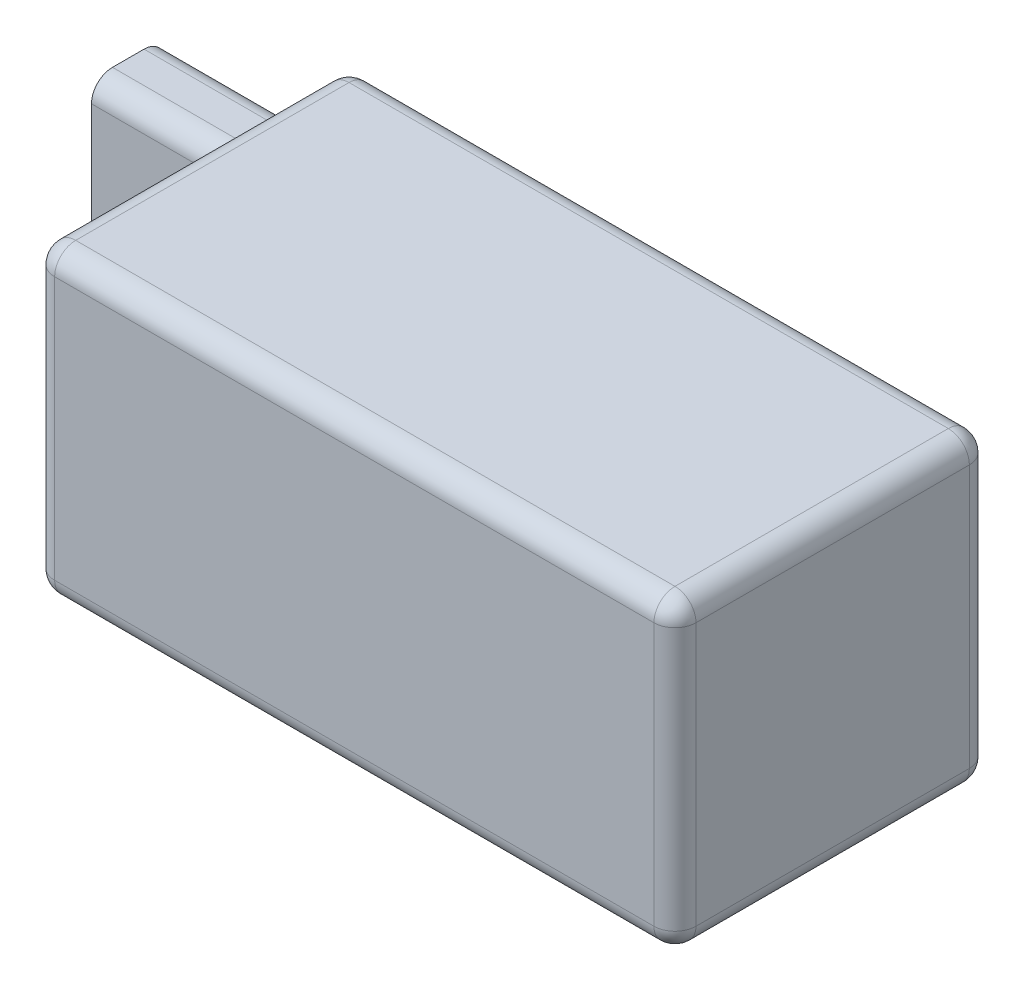
ISO-10303-21;
HEADER;
FILE_DESCRIPTION(('STEP AP214'),'2;1');
FILE_NAME('part.step','',(''),(''),'','','');
FILE_SCHEMA(('AUTOMOTIVE_DESIGN { 1 0 10303 214 1 1 1 1 }'));
ENDSEC;
DATA;
#1=APPLICATION_CONTEXT('core data for automotive mechanical design processes');
#2=APPLICATION_PROTOCOL_DEFINITION('international standard','automotive_design',2000,#1);
#3=PRODUCT_CONTEXT('',#1,'mechanical');
#4=PRODUCT('Part','Part','',(#3));
#5=PRODUCT_RELATED_PRODUCT_CATEGORY('part','',(#4));
#6=PRODUCT_DEFINITION_FORMATION('','',#4);
#7=PRODUCT_DEFINITION_CONTEXT('part definition',#1,'design');
#8=PRODUCT_DEFINITION('design','',#6,#7);
#9=PRODUCT_DEFINITION_SHAPE('','',#8);
#10=(LENGTH_UNIT() NAMED_UNIT(*) SI_UNIT(.MILLI.,.METRE.));
#11=(NAMED_UNIT(*) PLANE_ANGLE_UNIT() SI_UNIT($,.RADIAN.));
#12=(NAMED_UNIT(*) SI_UNIT($,.STERADIAN.) SOLID_ANGLE_UNIT());
#13=UNCERTAINTY_MEASURE_WITH_UNIT(LENGTH_MEASURE(1.E-05),#10,'distance_accuracy_value','');
#14=(GEOMETRIC_REPRESENTATION_CONTEXT(3) GLOBAL_UNCERTAINTY_ASSIGNED_CONTEXT((#13)) GLOBAL_UNIT_ASSIGNED_CONTEXT((#10,
#11,#12)) REPRESENTATION_CONTEXT('',''));
#15=CARTESIAN_POINT('',(0.,0.,0.));
#16=DIRECTION('',(0.,0.,1.));
#17=DIRECTION('',(1.,0.,0.));
#18=AXIS2_PLACEMENT_3D('',#15,#16,#17);
#19=CARTESIAN_POINT('',(-30.5,29.,15.));
#20=DIRECTION('',(1.,0.,0.));
#21=DIRECTION('',(0.,0.,-1.));
#22=AXIS2_PLACEMENT_3D('',#19,#20,#21);
#23=PLANE('',#22);
#24=DIRECTION('',(0.,0.,1.));
#25=VECTOR('',#24,1.);
#26=CARTESIAN_POINT('',(-30.5,27.,-15.));
#27=LINE('',#26,#25);
#28=CARTESIAN_POINT('',(-30.5,27.,13.));
#29=VERTEX_POINT('',#28);
#30=CARTESIAN_POINT('',(-30.5,27.,-13.));
#31=VERTEX_POINT('',#30);
#32=EDGE_CURVE('E223',#29,#31,#27,.F.);
#33=ORIENTED_EDGE('',*,*,#32,.T.);
#34=DIRECTION('',(0.,-1.,0.));
#35=VECTOR('',#34,1.);
#36=CARTESIAN_POINT('',(-30.5,29.,-13.));
#37=LINE('',#36,#35);
#38=CARTESIAN_POINT('',(-30.5,22.,-13.));
#39=VERTEX_POINT('',#38);
#40=EDGE_CURVE('E225',#31,#39,#37,.T.);
#41=ORIENTED_EDGE('',*,*,#40,.T.);
#42=DIRECTION('',(0.,0.,-1.));
#43=VECTOR('',#42,1.);
#44=CARTESIAN_POINT('',(-30.5,22.,-8.));
#45=LINE('',#44,#43);
#46=CARTESIAN_POINT('',(-30.5,22.,-9.99999999999999));
#47=VERTEX_POINT('',#46);
#48=EDGE_CURVE('E483',#47,#39,#45,.T.);
#49=ORIENTED_EDGE('',*,*,#48,.F.);
#50=CARTESIAN_POINT('',(-30.5,20.,-10.));
#51=DIRECTION('',(1.,0.,0.));
#52=DIRECTION('',(0.,0.,-1.));
#53=AXIS2_PLACEMENT_3D('',#50,#51,#52);
#54=CIRCLE('',#53,2.);
#55=CARTESIAN_POINT('',(-30.5,20.,-8.));
#56=VERTEX_POINT('',#55);
#57=EDGE_CURVE('E457',#47,#56,#54,.T.);
#58=ORIENTED_EDGE('',*,*,#57,.T.);
#59=DIRECTION('',(0.,1.,0.));
#60=VECTOR('',#59,1.);
#61=CARTESIAN_POINT('',(-30.5,7.,-8.));
#62=LINE('',#61,#60);
#63=CARTESIAN_POINT('',(-30.5,9.,-8.));
#64=VERTEX_POINT('',#63);
#65=EDGE_CURVE('E205',#64,#56,#62,.T.);
#66=ORIENTED_EDGE('',*,*,#65,.F.);
#67=CARTESIAN_POINT('',(-30.5,9.,-10.));
#68=DIRECTION('',(1.,0.,0.));
#69=DIRECTION('',(0.,0.,-1.));
#70=AXIS2_PLACEMENT_3D('',#67,#68,#69);
#71=CIRCLE('',#70,2.);
#72=CARTESIAN_POINT('',(-30.5,7.,-9.99999999999999));
#73=VERTEX_POINT('',#72);
#74=EDGE_CURVE('E204',#64,#73,#71,.T.);
#75=ORIENTED_EDGE('',*,*,#74,.T.);
#76=DIRECTION('',(0.,0.,1.));
#77=VECTOR('',#76,1.);
#78=CARTESIAN_POINT('',(-30.5,7.,-8.));
#79=LINE('',#78,#77);
#80=CARTESIAN_POINT('',(-30.5,7.,-13.));
#81=VERTEX_POINT('',#80);
#82=EDGE_CURVE('E193',#81,#73,#79,.T.);
#83=ORIENTED_EDGE('',*,*,#82,.F.);
#84=DIRECTION('',(0.,-1.,0.));
#85=VECTOR('',#84,1.);
#86=CARTESIAN_POINT('',(-30.5,29.,-13.));
#87=LINE('',#86,#85);
#88=CARTESIAN_POINT('',(-30.5,2.,-13.));
#89=VERTEX_POINT('',#88);
#90=EDGE_CURVE('E201',#81,#89,#87,.T.);
#91=ORIENTED_EDGE('',*,*,#90,.T.);
#92=DIRECTION('',(0.,0.,1.));
#93=VECTOR('',#92,1.);
#94=CARTESIAN_POINT('',(-30.5,2.,15.));
#95=LINE('',#94,#93);
#96=CARTESIAN_POINT('',(-30.5,2.,13.));
#97=VERTEX_POINT('',#96);
#98=EDGE_CURVE('E212',#89,#97,#95,.T.);
#99=ORIENTED_EDGE('',*,*,#98,.T.);
#100=DIRECTION('',(0.,-1.,0.));
#101=VECTOR('',#100,1.);
#102=CARTESIAN_POINT('',(-30.5,29.,13.));
#103=LINE('',#102,#101);
#104=EDGE_CURVE('E215',#97,#29,#103,.F.);
#105=ORIENTED_EDGE('',*,*,#104,.T.);
#106=EDGE_LOOP('',(#33,#41,#49,#58,#66,#75,#83,#91,#99,#105));
#107=FACE_BOUND('',#106,.T.);
#108=ADVANCED_FACE('F42',(#107),#23,.F.);
#109=CARTESIAN_POINT('',(30.5,29.,15.));
#110=DIRECTION('',(0.,0.,-1.));
#111=DIRECTION('',(-1.,0.,0.));
#112=AXIS2_PLACEMENT_3D('',#109,#110,#111);
#113=PLANE('',#112);
#114=DIRECTION('',(1.,0.,0.));
#115=VECTOR('',#114,1.);
#116=CARTESIAN_POINT('',(-30.5,27.,15.));
#117=LINE('',#116,#115);
#118=CARTESIAN_POINT('',(28.5,27.,15.));
#119=VERTEX_POINT('',#118);
#120=CARTESIAN_POINT('',(-28.5,27.,15.));
#121=VERTEX_POINT('',#120);
#122=EDGE_CURVE('E59',#119,#121,#117,.F.);
#123=ORIENTED_EDGE('',*,*,#122,.T.);
#124=DIRECTION('',(0.,-1.,0.));
#125=VECTOR('',#124,1.);
#126=CARTESIAN_POINT('',(-28.5,29.,15.));
#127=LINE('',#126,#125);
#128=CARTESIAN_POINT('',(-28.5,2.,15.));
#129=VERTEX_POINT('',#128);
#130=EDGE_CURVE('E240',#121,#129,#127,.T.);
#131=ORIENTED_EDGE('',*,*,#130,.T.);
#132=DIRECTION('',(1.,0.,0.));
#133=VECTOR('',#132,1.);
#134=CARTESIAN_POINT('',(30.5,2.,15.));
#135=LINE('',#134,#133);
#136=CARTESIAN_POINT('',(28.5,2.,15.));
#137=VERTEX_POINT('',#136);
#138=EDGE_CURVE('E236',#129,#137,#135,.T.);
#139=ORIENTED_EDGE('',*,*,#138,.T.);
#140=DIRECTION('',(0.,-1.,0.));
#141=VECTOR('',#140,1.);
#142=CARTESIAN_POINT('',(28.5,29.,15.));
#143=LINE('',#142,#141);
#144=EDGE_CURVE('E64',#137,#119,#143,.F.);
#145=ORIENTED_EDGE('',*,*,#144,.T.);
#146=EDGE_LOOP('',(#123,#131,#139,#145));
#147=FACE_BOUND('',#146,.T.);
#148=ADVANCED_FACE('F391',(#147),#113,.F.);
#149=CARTESIAN_POINT('',(30.5,29.,15.));
#150=DIRECTION('',(-1.,0.,0.));
#151=DIRECTION('',(0.,0.,1.));
#152=AXIS2_PLACEMENT_3D('',#149,#150,#151);
#153=PLANE('',#152);
#154=DIRECTION('',(0.,0.,-1.));
#155=VECTOR('',#154,1.);
#156=CARTESIAN_POINT('',(30.5,2.,15.));
#157=LINE('',#156,#155);
#158=CARTESIAN_POINT('',(30.5,2.,13.));
#159=VERTEX_POINT('',#158);
#160=CARTESIAN_POINT('',(30.5,2.,-13.));
#161=VERTEX_POINT('',#160);
#162=EDGE_CURVE('E368',#159,#161,#157,.T.);
#163=ORIENTED_EDGE('',*,*,#162,.T.);
#164=DIRECTION('',(0.,-1.,0.));
#165=VECTOR('',#164,1.);
#166=CARTESIAN_POINT('',(30.5,29.,-13.));
#167=LINE('',#166,#165);
#168=CARTESIAN_POINT('',(30.5,27.,-13.));
#169=VERTEX_POINT('',#168);
#170=EDGE_CURVE('E326',#161,#169,#167,.F.);
#171=ORIENTED_EDGE('',*,*,#170,.T.);
#172=DIRECTION('',(0.,0.,-1.));
#173=VECTOR('',#172,1.);
#174=CARTESIAN_POINT('',(30.5,27.,15.));
#175=LINE('',#174,#173);
#176=CARTESIAN_POINT('',(30.5,27.,13.));
#177=VERTEX_POINT('',#176);
#178=EDGE_CURVE('E330',#169,#177,#175,.F.);
#179=ORIENTED_EDGE('',*,*,#178,.T.);
#180=DIRECTION('',(0.,-1.,0.));
#181=VECTOR('',#180,1.);
#182=CARTESIAN_POINT('',(30.5,29.,13.));
#183=LINE('',#182,#181);
#184=EDGE_CURVE('E366',#177,#159,#183,.T.);
#185=ORIENTED_EDGE('',*,*,#184,.T.);
#186=EDGE_LOOP('',(#163,#171,#179,#185));
#187=FACE_BOUND('',#186,.T.);
#188=ADVANCED_FACE('F371',(#187),#153,.F.);
#189=CARTESIAN_POINT('',(30.5,29.,-15.));
#190=DIRECTION('',(0.,0.,1.));
#191=DIRECTION('',(1.,0.,0.));
#192=AXIS2_PLACEMENT_3D('',#189,#190,#191);
#193=PLANE('',#192);
#194=DIRECTION('',(1.,0.,0.));
#195=VECTOR('',#194,1.);
#196=CARTESIAN_POINT('',(30.5,20.,-15.));
#197=LINE('',#196,#195);
#198=CARTESIAN_POINT('',(-48.,20.,-15.));
#199=VERTEX_POINT('',#198);
#200=CARTESIAN_POINT('',(-28.5,20.,-15.));
#201=VERTEX_POINT('',#200);
#202=EDGE_CURVE('E197',#199,#201,#197,.T.);
#203=ORIENTED_EDGE('',*,*,#202,.T.);
#204=DIRECTION('',(0.,-1.,0.));
#205=VECTOR('',#204,1.);
#206=CARTESIAN_POINT('',(-28.5,29.,-15.));
#207=LINE('',#206,#205);
#208=CARTESIAN_POINT('',(-28.5,27.,-15.));
#209=VERTEX_POINT('',#208);
#210=EDGE_CURVE('E359',#201,#209,#207,.F.);
#211=ORIENTED_EDGE('',*,*,#210,.T.);
#212=DIRECTION('',(-1.,0.,0.));
#213=VECTOR('',#212,1.);
#214=CARTESIAN_POINT('',(30.5,27.,-15.));
#215=LINE('',#214,#213);
#216=CARTESIAN_POINT('',(28.5,27.,-15.));
#217=VERTEX_POINT('',#216);
#218=EDGE_CURVE('E356',#209,#217,#215,.F.);
#219=ORIENTED_EDGE('',*,*,#218,.T.);
#220=DIRECTION('',(0.,-1.,0.));
#221=VECTOR('',#220,1.);
#222=CARTESIAN_POINT('',(28.5,29.,-15.));
#223=LINE('',#222,#221);
#224=CARTESIAN_POINT('',(28.5,2.,-15.));
#225=VERTEX_POINT('',#224);
#226=EDGE_CURVE('E352',#217,#225,#223,.T.);
#227=ORIENTED_EDGE('',*,*,#226,.T.);
#228=DIRECTION('',(-1.,0.,0.));
#229=VECTOR('',#228,1.);
#230=CARTESIAN_POINT('',(30.5,2.,-15.));
#231=LINE('',#230,#229);
#232=CARTESIAN_POINT('',(-28.5,2.,-15.));
#233=VERTEX_POINT('',#232);
#234=EDGE_CURVE('E357',#225,#233,#231,.T.);
#235=ORIENTED_EDGE('',*,*,#234,.T.);
#236=DIRECTION('',(0.,-1.,0.));
#237=VECTOR('',#236,1.);
#238=CARTESIAN_POINT('',(-28.5,29.,-15.));
#239=LINE('',#238,#237);
#240=CARTESIAN_POINT('',(-28.5,9.,-15.));
#241=VERTEX_POINT('',#240);
#242=EDGE_CURVE('E361',#233,#241,#239,.F.);
#243=ORIENTED_EDGE('',*,*,#242,.T.);
#244=DIRECTION('',(1.,0.,0.));
#245=VECTOR('',#244,1.);
#246=CARTESIAN_POINT('',(30.5,9.,-15.));
#247=LINE('',#246,#245);
#248=CARTESIAN_POINT('',(-48.,9.,-15.));
#249=VERTEX_POINT('',#248);
#250=EDGE_CURVE('E183',#241,#249,#247,.F.);
#251=ORIENTED_EDGE('',*,*,#250,.T.);
#252=DIRECTION('',(0.,-1.,0.));
#253=VECTOR('',#252,1.);
#254=CARTESIAN_POINT('',(-48.,7.,-15.));
#255=LINE('',#254,#253);
#256=EDGE_CURVE('E486',#199,#249,#255,.T.);
#257=ORIENTED_EDGE('',*,*,#256,.F.);
#258=EDGE_LOOP('',(#203,#211,#219,#227,#235,#243,#251,#257));
#259=FACE_BOUND('',#258,.T.);
#260=ADVANCED_FACE('F456',(#259),#193,.F.);
#261=CARTESIAN_POINT('',(0.,29.,0.));
#262=DIRECTION('',(0.,1.,0.));
#263=DIRECTION('',(0.,0.,1.));
#264=AXIS2_PLACEMENT_3D('',#261,#262,#263);
#265=PLANE('',#264);
#266=DIRECTION('',(0.,0.,-1.));
#267=VECTOR('',#266,1.);
#268=CARTESIAN_POINT('',(28.5,29.,-15.));
#269=LINE('',#268,#267);
#270=CARTESIAN_POINT('',(28.5,29.,13.));
#271=VERTEX_POINT('',#270);
#272=CARTESIAN_POINT('',(28.5,29.,-13.));
#273=VERTEX_POINT('',#272);
#274=EDGE_CURVE('E218',#271,#273,#269,.T.);
#275=ORIENTED_EDGE('',*,*,#274,.T.);
#276=DIRECTION('',(-1.,0.,0.));
#277=VECTOR('',#276,1.);
#278=CARTESIAN_POINT('',(-30.5,29.,-13.));
#279=LINE('',#278,#277);
#280=CARTESIAN_POINT('',(-28.5,29.,-13.));
#281=VERTEX_POINT('',#280);
#282=EDGE_CURVE('E213',#273,#281,#279,.T.);
#283=ORIENTED_EDGE('',*,*,#282,.T.);
#284=DIRECTION('',(0.,0.,1.));
#285=VECTOR('',#284,1.);
#286=CARTESIAN_POINT('',(-28.5,29.,15.));
#287=LINE('',#286,#285);
#288=CARTESIAN_POINT('',(-28.5,29.,13.));
#289=VERTEX_POINT('',#288);
#290=EDGE_CURVE('E325',#281,#289,#287,.T.);
#291=ORIENTED_EDGE('',*,*,#290,.T.);
#292=DIRECTION('',(1.,0.,0.));
#293=VECTOR('',#292,1.);
#294=CARTESIAN_POINT('',(30.5,29.,13.));
#295=LINE('',#294,#293);
#296=EDGE_CURVE('E322',#289,#271,#295,.T.);
#297=ORIENTED_EDGE('',*,*,#296,.T.);
#298=EDGE_LOOP('',(#275,#283,#291,#297));
#299=FACE_BOUND('',#298,.T.);
#300=ADVANCED_FACE('F335',(#299),#265,.T.);
#301=CARTESIAN_POINT('',(0.,0.,0.));
#302=DIRECTION('',(0.,1.,0.));
#303=DIRECTION('',(0.,0.,1.));
#304=AXIS2_PLACEMENT_3D('',#301,#302,#303);
#305=PLANE('',#304);
#306=DIRECTION('',(-1.,0.,0.));
#307=VECTOR('',#306,1.);
#308=CARTESIAN_POINT('',(0.,0.,-13.));
#309=LINE('',#308,#307);
#310=CARTESIAN_POINT('',(-28.5,0.,-13.));
#311=VERTEX_POINT('',#310);
#312=CARTESIAN_POINT('',(28.5,0.,-13.));
#313=VERTEX_POINT('',#312);
#314=EDGE_CURVE('E231',#311,#313,#309,.F.);
#315=ORIENTED_EDGE('',*,*,#314,.T.);
#316=DIRECTION('',(0.,0.,-1.));
#317=VECTOR('',#316,1.);
#318=CARTESIAN_POINT('',(28.5,0.,0.));
#319=LINE('',#318,#317);
#320=CARTESIAN_POINT('',(28.5,0.,13.));
#321=VERTEX_POINT('',#320);
#322=EDGE_CURVE('E233',#313,#321,#319,.F.);
#323=ORIENTED_EDGE('',*,*,#322,.T.);
#324=DIRECTION('',(1.,0.,0.));
#325=VECTOR('',#324,1.);
#326=CARTESIAN_POINT('',(0.,0.,13.));
#327=LINE('',#326,#325);
#328=CARTESIAN_POINT('',(-28.5,0.,13.));
#329=VERTEX_POINT('',#328);
#330=EDGE_CURVE('E227',#321,#329,#327,.F.);
#331=ORIENTED_EDGE('',*,*,#330,.T.);
#332=DIRECTION('',(0.,0.,1.));
#333=VECTOR('',#332,1.);
#334=CARTESIAN_POINT('',(-28.5,0.,0.));
#335=LINE('',#334,#333);
#336=EDGE_CURVE('E229',#329,#311,#335,.F.);
#337=ORIENTED_EDGE('',*,*,#336,.T.);
#338=EDGE_LOOP('',(#315,#323,#331,#337));
#339=FACE_BOUND('',#338,.T.);
#340=ADVANCED_FACE('F530',(#339),#305,.F.);
#341=CARTESIAN_POINT('',(-48.,7.,-8.));
#342=DIRECTION('',(0.,1.,0.));
#343=DIRECTION('',(0.,0.,1.));
#344=AXIS2_PLACEMENT_3D('',#341,#342,#343);
#345=PLANE('',#344);
#346=DIRECTION('',(0.,0.,1.));
#347=VECTOR('',#346,1.);
#348=CARTESIAN_POINT('',(-48.,7.,-8.));
#349=LINE('',#348,#347);
#350=CARTESIAN_POINT('',(-48.,7.,-13.));
#351=VERTEX_POINT('',#350);
#352=CARTESIAN_POINT('',(-48.,7.,-9.99999999999999));
#353=VERTEX_POINT('',#352);
#354=EDGE_CURVE('E196',#351,#353,#349,.T.);
#355=ORIENTED_EDGE('',*,*,#354,.F.);
#356=DIRECTION('',(1.,0.,0.));
#357=VECTOR('',#356,1.);
#358=CARTESIAN_POINT('',(-48.,7.,-13.));
#359=LINE('',#358,#357);
#360=EDGE_CURVE('E182',#351,#81,#359,.T.);
#361=ORIENTED_EDGE('',*,*,#360,.T.);
#362=ORIENTED_EDGE('',*,*,#82,.T.);
#363=DIRECTION('',(1.,0.,0.));
#364=VECTOR('',#363,1.);
#365=CARTESIAN_POINT('',(-48.,7.,-10.));
#366=LINE('',#365,#364);
#367=EDGE_CURVE('E198',#73,#353,#366,.F.);
#368=ORIENTED_EDGE('',*,*,#367,.T.);
#369=EDGE_LOOP('',(#355,#361,#362,#368));
#370=FACE_BOUND('',#369,.T.);
#371=ADVANCED_FACE('F192',(#370),#345,.F.);
#372=CARTESIAN_POINT('',(-48.,7.,-8.));
#373=DIRECTION('',(0.,0.,-1.));
#374=DIRECTION('',(-1.,0.,0.));
#375=AXIS2_PLACEMENT_3D('',#372,#373,#374);
#376=PLANE('',#375);
#377=DIRECTION('',(0.,1.,0.));
#378=VECTOR('',#377,1.);
#379=CARTESIAN_POINT('',(-48.,7.,-8.));
#380=LINE('',#379,#378);
#381=CARTESIAN_POINT('',(-48.,9.,-8.));
#382=VERTEX_POINT('',#381);
#383=CARTESIAN_POINT('',(-48.,20.,-8.));
#384=VERTEX_POINT('',#383);
#385=EDGE_CURVE('E491',#382,#384,#380,.T.);
#386=ORIENTED_EDGE('',*,*,#385,.F.);
#387=DIRECTION('',(1.,0.,0.));
#388=VECTOR('',#387,1.);
#389=CARTESIAN_POINT('',(-48.,9.,-8.));
#390=LINE('',#389,#388);
#391=EDGE_CURVE('E466',#382,#64,#390,.T.);
#392=ORIENTED_EDGE('',*,*,#391,.T.);
#393=ORIENTED_EDGE('',*,*,#65,.T.);
#394=DIRECTION('',(1.,0.,0.));
#395=VECTOR('',#394,1.);
#396=CARTESIAN_POINT('',(-48.,20.,-8.));
#397=LINE('',#396,#395);
#398=EDGE_CURVE('E469',#56,#384,#397,.F.);
#399=ORIENTED_EDGE('',*,*,#398,.T.);
#400=EDGE_LOOP('',(#386,#392,#393,#399));
#401=FACE_BOUND('',#400,.T.);
#402=ADVANCED_FACE('F520',(#401),#376,.F.);
#403=CARTESIAN_POINT('',(-48.,22.,-8.));
#404=DIRECTION('',(0.,-1.,0.));
#405=DIRECTION('',(0.,0.,-1.));
#406=AXIS2_PLACEMENT_3D('',#403,#404,#405);
#407=PLANE('',#406);
#408=ORIENTED_EDGE('',*,*,#48,.T.);
#409=DIRECTION('',(1.,0.,0.));
#410=VECTOR('',#409,1.);
#411=CARTESIAN_POINT('',(-48.,22.,-13.));
#412=LINE('',#411,#410);
#413=CARTESIAN_POINT('',(-48.,22.,-13.));
#414=VERTEX_POINT('',#413);
#415=EDGE_CURVE('E461',#39,#414,#412,.F.);
#416=ORIENTED_EDGE('',*,*,#415,.T.);
#417=DIRECTION('',(0.,0.,-1.));
#418=VECTOR('',#417,1.);
#419=CARTESIAN_POINT('',(-48.,22.,-8.));
#420=LINE('',#419,#418);
#421=CARTESIAN_POINT('',(-48.,22.,-9.99999999999999));
#422=VERTEX_POINT('',#421);
#423=EDGE_CURVE('E482',#422,#414,#420,.T.);
#424=ORIENTED_EDGE('',*,*,#423,.F.);
#425=DIRECTION('',(1.,0.,0.));
#426=VECTOR('',#425,1.);
#427=CARTESIAN_POINT('',(-48.,22.,-10.));
#428=LINE('',#427,#426);
#429=EDGE_CURVE('E463',#422,#47,#428,.T.);
#430=ORIENTED_EDGE('',*,*,#429,.T.);
#431=EDGE_LOOP('',(#408,#416,#424,#430));
#432=FACE_BOUND('',#431,.T.);
#433=ADVANCED_FACE('F513',(#432),#407,.F.);
#434=CARTESIAN_POINT('',(-48.,0.,0.));
#435=DIRECTION('',(-1.,0.,0.));
#436=DIRECTION('',(0.,0.,1.));
#437=AXIS2_PLACEMENT_3D('',#434,#435,#436);
#438=PLANE('',#437);
#439=ORIENTED_EDGE('',*,*,#256,.T.);
#440=CARTESIAN_POINT('',(-48.,9.,-13.));
#441=DIRECTION('',(-1.,0.,0.));
#442=DIRECTION('',(0.,0.,1.));
#443=AXIS2_PLACEMENT_3D('',#440,#441,#442);
#444=CIRCLE('',#443,2.);
#445=EDGE_CURVE('E471',#249,#351,#444,.T.);
#446=ORIENTED_EDGE('',*,*,#445,.T.);
#447=ORIENTED_EDGE('',*,*,#354,.T.);
#448=CARTESIAN_POINT('',(-48.,9.,-10.));
#449=DIRECTION('',(-1.,0.,0.));
#450=DIRECTION('',(0.,0.,1.));
#451=AXIS2_PLACEMENT_3D('',#448,#449,#450);
#452=CIRCLE('',#451,2.);
#453=EDGE_CURVE('E473',#353,#382,#452,.T.);
#454=ORIENTED_EDGE('',*,*,#453,.T.);
#455=ORIENTED_EDGE('',*,*,#385,.T.);
#456=CARTESIAN_POINT('',(-48.,20.,-10.));
#457=DIRECTION('',(-1.,0.,0.));
#458=DIRECTION('',(0.,0.,1.));
#459=AXIS2_PLACEMENT_3D('',#456,#457,#458);
#460=CIRCLE('',#459,2.);
#461=EDGE_CURVE('E477',#384,#422,#460,.T.);
#462=ORIENTED_EDGE('',*,*,#461,.T.);
#463=ORIENTED_EDGE('',*,*,#423,.T.);
#464=CARTESIAN_POINT('',(-48.,20.,-13.));
#465=DIRECTION('',(-1.,0.,0.));
#466=DIRECTION('',(0.,0.,1.));
#467=AXIS2_PLACEMENT_3D('',#464,#465,#466);
#468=CIRCLE('',#467,2.);
#469=EDGE_CURVE('E475',#414,#199,#468,.T.);
#470=ORIENTED_EDGE('',*,*,#469,.T.);
#471=EDGE_LOOP('',(#439,#446,#447,#454,#455,#462,#463,#470));
#472=FACE_BOUND('',#471,.T.);
#473=ADVANCED_FACE('F402',(#472),#438,.T.);
#474=CARTESIAN_POINT('',(-48.,9.,-13.));
#475=DIRECTION('',(1.,0.,0.));
#476=DIRECTION('',(0.,0.,-1.));
#477=AXIS2_PLACEMENT_3D('',#474,#475,#476);
#478=CYLINDRICAL_SURFACE('',#477,2.);
#479=ORIENTED_EDGE('',*,*,#445,.F.);
#480=ORIENTED_EDGE('',*,*,#250,.F.);
#481=CARTESIAN_POINT('',(-28.5,9.,-13.));
#482=DIRECTION('',(0.707106781186547,-0.707106781186547,0.));
#483=DIRECTION('',(-0.707106781186547,-0.707106781186547,0.));
#484=AXIS2_PLACEMENT_3D('',#481,#482,#483);
#485=ELLIPSE('',#484,2.82842712474619,2.);
#486=EDGE_CURVE('E11',#241,#81,#485,.F.);
#487=ORIENTED_EDGE('',*,*,#486,.T.);
#488=ORIENTED_EDGE('',*,*,#360,.F.);
#489=EDGE_LOOP('',(#479,#480,#487,#488));
#490=FACE_BOUND('',#489,.T.);
#491=ADVANCED_FACE('F181',(#490),#478,.T.);
#492=CARTESIAN_POINT('',(-48.,9.,-10.));
#493=DIRECTION('',(1.,0.,0.));
#494=DIRECTION('',(0.,0.,-1.));
#495=AXIS2_PLACEMENT_3D('',#492,#493,#494);
#496=CYLINDRICAL_SURFACE('',#495,2.);
#497=ORIENTED_EDGE('',*,*,#453,.F.);
#498=ORIENTED_EDGE('',*,*,#367,.F.);
#499=ORIENTED_EDGE('',*,*,#74,.F.);
#500=ORIENTED_EDGE('',*,*,#391,.F.);
#501=EDGE_LOOP('',(#497,#498,#499,#500));
#502=FACE_BOUND('',#501,.T.);
#503=ADVANCED_FACE('F401',(#502),#496,.T.);
#504=CARTESIAN_POINT('',(30.5,20.,-13.));
#505=DIRECTION('',(1.,0.,0.));
#506=DIRECTION('',(0.,0.,-1.));
#507=AXIS2_PLACEMENT_3D('',#504,#505,#506);
#508=CYLINDRICAL_SURFACE('',#507,2.);
#509=ORIENTED_EDGE('',*,*,#469,.F.);
#510=ORIENTED_EDGE('',*,*,#415,.F.);
#511=CARTESIAN_POINT('',(-28.5,20.,-13.));
#512=DIRECTION('',(-0.707106781186547,-0.707106781186547,0.));
#513=DIRECTION('',(0.707106781186547,-0.707106781186547,0.));
#514=AXIS2_PLACEMENT_3D('',#511,#512,#513);
#515=ELLIPSE('',#514,2.82842712474619,2.);
#516=EDGE_CURVE('E51',#39,#201,#515,.T.);
#517=ORIENTED_EDGE('',*,*,#516,.T.);
#518=ORIENTED_EDGE('',*,*,#202,.F.);
#519=EDGE_LOOP('',(#509,#510,#517,#518));
#520=FACE_BOUND('',#519,.T.);
#521=ADVANCED_FACE('F405',(#520),#508,.T.);
#522=CARTESIAN_POINT('',(-48.,20.,-10.));
#523=DIRECTION('',(1.,0.,0.));
#524=DIRECTION('',(0.,0.,-1.));
#525=AXIS2_PLACEMENT_3D('',#522,#523,#524);
#526=CYLINDRICAL_SURFACE('',#525,2.);
#527=ORIENTED_EDGE('',*,*,#461,.F.);
#528=ORIENTED_EDGE('',*,*,#398,.F.);
#529=ORIENTED_EDGE('',*,*,#57,.F.);
#530=ORIENTED_EDGE('',*,*,#429,.F.);
#531=EDGE_LOOP('',(#527,#528,#529,#530));
#532=FACE_BOUND('',#531,.T.);
#533=ADVANCED_FACE('F409',(#532),#526,.T.);
#534=CARTESIAN_POINT('',(-28.5,29.,13.));
#535=DIRECTION('',(0.,-1.,0.));
#536=DIRECTION('',(0.,0.,-1.));
#537=AXIS2_PLACEMENT_3D('',#534,#535,#536);
#538=CYLINDRICAL_SURFACE('',#537,2.);
#539=CARTESIAN_POINT('',(-28.5,27.,13.));
#540=DIRECTION('',(0.,1.,0.));
#541=DIRECTION('',(0.,0.,1.));
#542=AXIS2_PLACEMENT_3D('',#539,#540,#541);
#543=CIRCLE('',#542,2.);
#544=EDGE_CURVE('E46',#29,#121,#543,.T.);
#545=ORIENTED_EDGE('',*,*,#544,.F.);
#546=ORIENTED_EDGE('',*,*,#104,.F.);
#547=CARTESIAN_POINT('',(-28.5,2.,13.));
#548=DIRECTION('',(0.,-1.,0.));
#549=DIRECTION('',(0.,0.,-1.));
#550=AXIS2_PLACEMENT_3D('',#547,#548,#549);
#551=CIRCLE('',#550,2.);
#552=EDGE_CURVE('E302',#129,#97,#551,.T.);
#553=ORIENTED_EDGE('',*,*,#552,.F.);
#554=ORIENTED_EDGE('',*,*,#130,.F.);
#555=EDGE_LOOP('',(#545,#546,#553,#554));
#556=FACE_BOUND('',#555,.T.);
#557=ADVANCED_FACE('F44',(#556),#538,.T.);
#558=CARTESIAN_POINT('',(-28.5,27.,13.));
#559=DIRECTION('',(0.,0.,1.));
#560=DIRECTION('',(1.,0.,0.));
#561=AXIS2_PLACEMENT_3D('',#558,#559,#560);
#562=SPHERICAL_SURFACE('',#561,2.);
#563=CARTESIAN_POINT('',(-28.5,27.,13.));
#564=DIRECTION('',(0.,0.,1.));
#565=DIRECTION('',(1.,0.,0.));
#566=AXIS2_PLACEMENT_3D('',#563,#564,#565);
#567=CIRCLE('',#566,2.);
#568=EDGE_CURVE('E297',#29,#289,#567,.F.);
#569=ORIENTED_EDGE('',*,*,#568,.F.);
#570=ORIENTED_EDGE('',*,*,#544,.T.);
#571=CARTESIAN_POINT('',(-28.5,27.,13.));
#572=DIRECTION('',(-1.,0.,0.));
#573=DIRECTION('',(0.,-1.,0.));
#574=AXIS2_PLACEMENT_3D('',#571,#572,#573);
#575=CIRCLE('',#574,2.);
#576=EDGE_CURVE('E300',#289,#121,#575,.F.);
#577=ORIENTED_EDGE('',*,*,#576,.F.);
#578=EDGE_LOOP('',(#569,#570,#577));
#579=FACE_BOUND('',#578,.T.);
#580=ADVANCED_FACE('F313',(#579),#562,.T.);
#581=CARTESIAN_POINT('',(-28.5,2.,13.));
#582=DIRECTION('',(-1.,0.,0.));
#583=DIRECTION('',(0.,-1.,0.));
#584=AXIS2_PLACEMENT_3D('',#581,#582,#583);
#585=SPHERICAL_SURFACE('',#584,2.);
#586=CARTESIAN_POINT('',(-28.5,2.,13.));
#587=DIRECTION('',(-1.,0.,0.));
#588=DIRECTION('',(0.,0.,1.));
#589=AXIS2_PLACEMENT_3D('',#586,#587,#588);
#590=CIRCLE('',#589,2.);
#591=EDGE_CURVE('E291',#129,#329,#590,.F.);
#592=ORIENTED_EDGE('',*,*,#591,.F.);
#593=ORIENTED_EDGE('',*,*,#552,.T.);
#594=CARTESIAN_POINT('',(-28.5,2.,13.));
#595=DIRECTION('',(0.,0.,1.));
#596=DIRECTION('',(1.,0.,0.));
#597=AXIS2_PLACEMENT_3D('',#594,#595,#596);
#598=CIRCLE('',#597,2.);
#599=EDGE_CURVE('E294',#329,#97,#598,.F.);
#600=ORIENTED_EDGE('',*,*,#599,.F.);
#601=EDGE_LOOP('',(#592,#593,#600));
#602=FACE_BOUND('',#601,.T.);
#603=ADVANCED_FACE('F618',(#602),#585,.T.);
#604=CARTESIAN_POINT('',(0.,27.,13.));
#605=DIRECTION('',(-1.,0.,0.));
#606=DIRECTION('',(0.,0.,1.));
#607=AXIS2_PLACEMENT_3D('',#604,#605,#606);
#608=CYLINDRICAL_SURFACE('',#607,2.);
#609=ORIENTED_EDGE('',*,*,#576,.T.);
#610=ORIENTED_EDGE('',*,*,#122,.F.);
#611=CARTESIAN_POINT('',(28.5,27.,13.));
#612=DIRECTION('',(1.,0.,0.));
#613=DIRECTION('',(0.,0.,-1.));
#614=AXIS2_PLACEMENT_3D('',#611,#612,#613);
#615=CIRCLE('',#614,2.);
#616=EDGE_CURVE('E285',#271,#119,#615,.T.);
#617=ORIENTED_EDGE('',*,*,#616,.F.);
#618=ORIENTED_EDGE('',*,*,#296,.F.);
#619=EDGE_LOOP('',(#609,#610,#617,#618));
#620=FACE_BOUND('',#619,.T.);
#621=ADVANCED_FACE('F319',(#620),#608,.T.);
#622=CARTESIAN_POINT('',(-28.5,27.,0.));
#623=DIRECTION('',(0.,0.,-1.));
#624=DIRECTION('',(-1.,0.,0.));
#625=AXIS2_PLACEMENT_3D('',#622,#623,#624);
#626=CYLINDRICAL_SURFACE('',#625,2.);
#627=ORIENTED_EDGE('',*,*,#568,.T.);
#628=ORIENTED_EDGE('',*,*,#290,.F.);
#629=CARTESIAN_POINT('',(-28.5,27.,-13.));
#630=DIRECTION('',(0.,0.,-1.));
#631=DIRECTION('',(0.,1.,0.));
#632=AXIS2_PLACEMENT_3D('',#629,#630,#631);
#633=CIRCLE('',#632,2.);
#634=EDGE_CURVE('E282',#31,#281,#633,.T.);
#635=ORIENTED_EDGE('',*,*,#634,.F.);
#636=ORIENTED_EDGE('',*,*,#32,.F.);
#637=EDGE_LOOP('',(#627,#628,#635,#636));
#638=FACE_BOUND('',#637,.T.);
#639=ADVANCED_FACE('F510',(#638),#626,.T.);
#640=CARTESIAN_POINT('',(-28.5,29.,-13.));
#641=DIRECTION('',(0.,-1.,0.));
#642=DIRECTION('',(0.,0.,-1.));
#643=AXIS2_PLACEMENT_3D('',#640,#641,#642);
#644=CYLINDRICAL_SURFACE('',#643,2.);
#645=ORIENTED_EDGE('',*,*,#516,.F.);
#646=ORIENTED_EDGE('',*,*,#40,.F.);
#647=CARTESIAN_POINT('',(-28.5,27.,-13.));
#648=DIRECTION('',(0.,1.,0.));
#649=DIRECTION('',(0.,0.,1.));
#650=AXIS2_PLACEMENT_3D('',#647,#648,#649);
#651=CIRCLE('',#650,2.);
#652=EDGE_CURVE('E279',#209,#31,#651,.T.);
#653=ORIENTED_EDGE('',*,*,#652,.F.);
#654=ORIENTED_EDGE('',*,*,#210,.F.);
#655=EDGE_LOOP('',(#645,#646,#653,#654));
#656=FACE_BOUND('',#655,.T.);
#657=ADVANCED_FACE('F506',(#656),#644,.T.);
#658=CARTESIAN_POINT('',(-28.5,29.,-13.));
#659=DIRECTION('',(0.,-1.,0.));
#660=DIRECTION('',(0.,0.,-1.));
#661=AXIS2_PLACEMENT_3D('',#658,#659,#660);
#662=CYLINDRICAL_SURFACE('',#661,2.);
#663=ORIENTED_EDGE('',*,*,#486,.F.);
#664=ORIENTED_EDGE('',*,*,#242,.F.);
#665=CARTESIAN_POINT('',(-28.5,2.,-13.));
#666=DIRECTION('',(0.,-1.,0.));
#667=DIRECTION('',(0.,0.,-1.));
#668=AXIS2_PLACEMENT_3D('',#665,#666,#667);
#669=CIRCLE('',#668,2.);
#670=EDGE_CURVE('E210',#89,#233,#669,.T.);
#671=ORIENTED_EDGE('',*,*,#670,.F.);
#672=ORIENTED_EDGE('',*,*,#90,.F.);
#673=EDGE_LOOP('',(#663,#664,#671,#672));
#674=FACE_BOUND('',#673,.T.);
#675=ADVANCED_FACE('F208',(#674),#662,.T.);
#676=CARTESIAN_POINT('',(-28.5,2.,15.));
#677=DIRECTION('',(0.,0.,1.));
#678=DIRECTION('',(1.,0.,0.));
#679=AXIS2_PLACEMENT_3D('',#676,#677,#678);
#680=CYLINDRICAL_SURFACE('',#679,2.);
#681=ORIENTED_EDGE('',*,*,#599,.T.);
#682=ORIENTED_EDGE('',*,*,#98,.F.);
#683=CARTESIAN_POINT('',(-28.5,2.,-13.));
#684=DIRECTION('',(0.,0.,-1.));
#685=DIRECTION('',(-1.,0.,0.));
#686=AXIS2_PLACEMENT_3D('',#683,#684,#685);
#687=CIRCLE('',#686,2.);
#688=EDGE_CURVE('E276',#311,#89,#687,.T.);
#689=ORIENTED_EDGE('',*,*,#688,.F.);
#690=ORIENTED_EDGE('',*,*,#336,.F.);
#691=EDGE_LOOP('',(#681,#682,#689,#690));
#692=FACE_BOUND('',#691,.T.);
#693=ADVANCED_FACE('F447',(#692),#680,.T.);
#694=CARTESIAN_POINT('',(30.5,2.,13.));
#695=DIRECTION('',(1.,0.,0.));
#696=DIRECTION('',(0.,0.,-1.));
#697=AXIS2_PLACEMENT_3D('',#694,#695,#696);
#698=CYLINDRICAL_SURFACE('',#697,2.);
#699=ORIENTED_EDGE('',*,*,#591,.T.);
#700=ORIENTED_EDGE('',*,*,#330,.F.);
#701=CARTESIAN_POINT('',(28.5,2.,13.));
#702=DIRECTION('',(1.,0.,0.));
#703=DIRECTION('',(0.,0.,-1.));
#704=AXIS2_PLACEMENT_3D('',#701,#702,#703);
#705=CIRCLE('',#704,2.);
#706=EDGE_CURVE('E273',#137,#321,#705,.T.);
#707=ORIENTED_EDGE('',*,*,#706,.F.);
#708=ORIENTED_EDGE('',*,*,#138,.F.);
#709=EDGE_LOOP('',(#699,#700,#707,#708));
#710=FACE_BOUND('',#709,.T.);
#711=ADVANCED_FACE('F388',(#710),#698,.T.);
#712=CARTESIAN_POINT('',(28.5,29.,13.));
#713=DIRECTION('',(0.,-1.,0.));
#714=DIRECTION('',(0.,0.,-1.));
#715=AXIS2_PLACEMENT_3D('',#712,#713,#714);
#716=CYLINDRICAL_SURFACE('',#715,2.);
#717=CARTESIAN_POINT('',(28.5,27.,13.));
#718=DIRECTION('',(0.,1.,0.));
#719=DIRECTION('',(0.,0.,1.));
#720=AXIS2_PLACEMENT_3D('',#717,#718,#719);
#721=CIRCLE('',#720,2.);
#722=EDGE_CURVE('E288',#119,#177,#721,.T.);
#723=ORIENTED_EDGE('',*,*,#722,.F.);
#724=ORIENTED_EDGE('',*,*,#144,.F.);
#725=CARTESIAN_POINT('',(28.5,2.,13.));
#726=DIRECTION('',(0.,-1.,0.));
#727=DIRECTION('',(0.,0.,-1.));
#728=AXIS2_PLACEMENT_3D('',#725,#726,#727);
#729=CIRCLE('',#728,2.);
#730=EDGE_CURVE('E270',#159,#137,#729,.T.);
#731=ORIENTED_EDGE('',*,*,#730,.F.);
#732=ORIENTED_EDGE('',*,*,#184,.F.);
#733=EDGE_LOOP('',(#723,#724,#731,#732));
#734=FACE_BOUND('',#733,.T.);
#735=ADVANCED_FACE('F374',(#734),#716,.T.);
#736=CARTESIAN_POINT('',(28.5,27.,13.));
#737=DIRECTION('',(0.,0.,1.));
#738=DIRECTION('',(1.,0.,0.));
#739=AXIS2_PLACEMENT_3D('',#736,#737,#738);
#740=SPHERICAL_SURFACE('',#739,2.);
#741=ORIENTED_EDGE('',*,*,#616,.T.);
#742=ORIENTED_EDGE('',*,*,#722,.T.);
#743=CARTESIAN_POINT('',(28.5,27.,13.));
#744=DIRECTION('',(0.,0.,1.));
#745=DIRECTION('',(1.,0.,0.));
#746=AXIS2_PLACEMENT_3D('',#743,#744,#745);
#747=CIRCLE('',#746,2.);
#748=EDGE_CURVE('E267',#271,#177,#747,.F.);
#749=ORIENTED_EDGE('',*,*,#748,.F.);
#750=EDGE_LOOP('',(#741,#742,#749));
#751=FACE_BOUND('',#750,.T.);
#752=ADVANCED_FACE('F377',(#751),#740,.T.);
#753=CARTESIAN_POINT('',(-28.5,27.,-13.));
#754=DIRECTION('',(-1.,0.,0.));
#755=DIRECTION('',(0.,0.,1.));
#756=AXIS2_PLACEMENT_3D('',#753,#754,#755);
#757=SPHERICAL_SURFACE('',#756,2.);
#758=ORIENTED_EDGE('',*,*,#652,.T.);
#759=ORIENTED_EDGE('',*,*,#634,.T.);
#760=CARTESIAN_POINT('',(-28.5,27.,-13.));
#761=DIRECTION('',(-1.,0.,0.));
#762=DIRECTION('',(0.,0.,1.));
#763=AXIS2_PLACEMENT_3D('',#760,#761,#762);
#764=CIRCLE('',#763,2.);
#765=EDGE_CURVE('E265',#209,#281,#764,.F.);
#766=ORIENTED_EDGE('',*,*,#765,.F.);
#767=EDGE_LOOP('',(#758,#759,#766));
#768=FACE_BOUND('',#767,.T.);
#769=ADVANCED_FACE('F379',(#768),#757,.T.);
#770=CARTESIAN_POINT('',(-28.5,2.,-13.));
#771=DIRECTION('',(-1.,0.,0.));
#772=DIRECTION('',(0.,0.,1.));
#773=AXIS2_PLACEMENT_3D('',#770,#771,#772);
#774=SPHERICAL_SURFACE('',#773,2.);
#775=ORIENTED_EDGE('',*,*,#688,.T.);
#776=ORIENTED_EDGE('',*,*,#670,.T.);
#777=CARTESIAN_POINT('',(-28.5,2.,-13.));
#778=DIRECTION('',(-1.,0.,0.));
#779=DIRECTION('',(0.,0.,1.));
#780=AXIS2_PLACEMENT_3D('',#777,#778,#779);
#781=CIRCLE('',#780,2.);
#782=EDGE_CURVE('E262',#311,#233,#781,.F.);
#783=ORIENTED_EDGE('',*,*,#782,.F.);
#784=EDGE_LOOP('',(#775,#776,#783));
#785=FACE_BOUND('',#784,.T.);
#786=ADVANCED_FACE('F385',(#785),#774,.T.);
#787=CARTESIAN_POINT('',(28.5,2.,13.));
#788=DIRECTION('',(0.,0.,1.));
#789=DIRECTION('',(0.,-1.,0.));
#790=AXIS2_PLACEMENT_3D('',#787,#788,#789);
#791=SPHERICAL_SURFACE('',#790,2.);
#792=ORIENTED_EDGE('',*,*,#730,.T.);
#793=ORIENTED_EDGE('',*,*,#706,.T.);
#794=CARTESIAN_POINT('',(28.5,2.,13.));
#795=DIRECTION('',(0.,0.,1.));
#796=DIRECTION('',(1.,0.,0.));
#797=AXIS2_PLACEMENT_3D('',#794,#795,#796);
#798=CIRCLE('',#797,2.);
#799=EDGE_CURVE('E260',#159,#321,#798,.F.);
#800=ORIENTED_EDGE('',*,*,#799,.F.);
#801=EDGE_LOOP('',(#792,#793,#800));
#802=FACE_BOUND('',#801,.T.);
#803=ADVANCED_FACE('F434',(#802),#791,.T.);
#804=CARTESIAN_POINT('',(28.5,27.,0.));
#805=DIRECTION('',(0.,0.,1.));
#806=DIRECTION('',(1.,0.,0.));
#807=AXIS2_PLACEMENT_3D('',#804,#805,#806);
#808=CYLINDRICAL_SURFACE('',#807,2.);
#809=ORIENTED_EDGE('',*,*,#748,.T.);
#810=ORIENTED_EDGE('',*,*,#178,.F.);
#811=CARTESIAN_POINT('',(28.5,27.,-13.));
#812=DIRECTION('',(0.,0.,-1.));
#813=DIRECTION('',(-1.,0.,0.));
#814=AXIS2_PLACEMENT_3D('',#811,#812,#813);
#815=CIRCLE('',#814,2.);
#816=EDGE_CURVE('E257',#273,#169,#815,.T.);
#817=ORIENTED_EDGE('',*,*,#816,.F.);
#818=ORIENTED_EDGE('',*,*,#274,.F.);
#819=EDGE_LOOP('',(#809,#810,#817,#818));
#820=FACE_BOUND('',#819,.T.);
#821=ADVANCED_FACE('F345',(#820),#808,.T.);
#822=CARTESIAN_POINT('',(0.,27.,-13.));
#823=DIRECTION('',(1.,0.,0.));
#824=DIRECTION('',(0.,0.,-1.));
#825=AXIS2_PLACEMENT_3D('',#822,#823,#824);
#826=CYLINDRICAL_SURFACE('',#825,2.);
#827=ORIENTED_EDGE('',*,*,#765,.T.);
#828=ORIENTED_EDGE('',*,*,#282,.F.);
#829=CARTESIAN_POINT('',(28.5,27.,-13.));
#830=DIRECTION('',(1.,0.,0.));
#831=DIRECTION('',(0.,0.,-1.));
#832=AXIS2_PLACEMENT_3D('',#829,#830,#831);
#833=CIRCLE('',#832,2.);
#834=EDGE_CURVE('E254',#217,#273,#833,.T.);
#835=ORIENTED_EDGE('',*,*,#834,.F.);
#836=ORIENTED_EDGE('',*,*,#218,.F.);
#837=EDGE_LOOP('',(#827,#828,#835,#836));
#838=FACE_BOUND('',#837,.T.);
#839=ADVANCED_FACE('F340',(#838),#826,.T.);
#840=CARTESIAN_POINT('',(30.5,2.,-13.));
#841=DIRECTION('',(-1.,0.,0.));
#842=DIRECTION('',(0.,0.,1.));
#843=AXIS2_PLACEMENT_3D('',#840,#841,#842);
#844=CYLINDRICAL_SURFACE('',#843,2.);
#845=ORIENTED_EDGE('',*,*,#782,.T.);
#846=ORIENTED_EDGE('',*,*,#234,.F.);
#847=CARTESIAN_POINT('',(28.5,2.,-13.));
#848=DIRECTION('',(1.,0.,0.));
#849=DIRECTION('',(0.,0.,-1.));
#850=AXIS2_PLACEMENT_3D('',#847,#848,#849);
#851=CIRCLE('',#850,2.);
#852=EDGE_CURVE('E251',#313,#225,#851,.T.);
#853=ORIENTED_EDGE('',*,*,#852,.F.);
#854=ORIENTED_EDGE('',*,*,#314,.F.);
#855=EDGE_LOOP('',(#845,#846,#853,#854));
#856=FACE_BOUND('',#855,.T.);
#857=ADVANCED_FACE('F425',(#856),#844,.T.);
#858=CARTESIAN_POINT('',(28.5,2.,15.));
#859=DIRECTION('',(0.,0.,-1.));
#860=DIRECTION('',(-1.,0.,0.));
#861=AXIS2_PLACEMENT_3D('',#858,#859,#860);
#862=CYLINDRICAL_SURFACE('',#861,2.);
#863=ORIENTED_EDGE('',*,*,#799,.T.);
#864=ORIENTED_EDGE('',*,*,#322,.F.);
#865=CARTESIAN_POINT('',(28.5,2.,-13.));
#866=DIRECTION('',(0.,0.,-1.));
#867=DIRECTION('',(-1.,0.,0.));
#868=AXIS2_PLACEMENT_3D('',#865,#866,#867);
#869=CIRCLE('',#868,2.);
#870=EDGE_CURVE('E248',#161,#313,#869,.T.);
#871=ORIENTED_EDGE('',*,*,#870,.F.);
#872=ORIENTED_EDGE('',*,*,#162,.F.);
#873=EDGE_LOOP('',(#863,#864,#871,#872));
#874=FACE_BOUND('',#873,.T.);
#875=ADVANCED_FACE('F422',(#874),#862,.T.);
#876=CARTESIAN_POINT('',(28.5,27.,-13.));
#877=DIRECTION('',(0.,1.,0.));
#878=DIRECTION('',(0.,0.,1.));
#879=AXIS2_PLACEMENT_3D('',#876,#877,#878);
#880=SPHERICAL_SURFACE('',#879,2.);
#881=ORIENTED_EDGE('',*,*,#834,.T.);
#882=ORIENTED_EDGE('',*,*,#816,.T.);
#883=CARTESIAN_POINT('',(28.5,27.,-13.));
#884=DIRECTION('',(0.,1.,0.));
#885=DIRECTION('',(0.,0.,1.));
#886=AXIS2_PLACEMENT_3D('',#883,#884,#885);
#887=CIRCLE('',#886,2.);
#888=EDGE_CURVE('E246',#217,#169,#887,.F.);
#889=ORIENTED_EDGE('',*,*,#888,.F.);
#890=EDGE_LOOP('',(#881,#882,#889));
#891=FACE_BOUND('',#890,.T.);
#892=ADVANCED_FACE('F347',(#891),#880,.T.);
#893=CARTESIAN_POINT('',(28.5,2.,-13.));
#894=DIRECTION('',(0.,-1.,0.));
#895=DIRECTION('',(0.,0.,-1.));
#896=AXIS2_PLACEMENT_3D('',#893,#894,#895);
#897=SPHERICAL_SURFACE('',#896,2.);
#898=ORIENTED_EDGE('',*,*,#870,.T.);
#899=ORIENTED_EDGE('',*,*,#852,.T.);
#900=CARTESIAN_POINT('',(28.5,2.,-13.));
#901=DIRECTION('',(0.,-1.,0.));
#902=DIRECTION('',(0.,0.,-1.));
#903=AXIS2_PLACEMENT_3D('',#900,#901,#902);
#904=CIRCLE('',#903,2.);
#905=EDGE_CURVE('E244',#161,#225,#904,.F.);
#906=ORIENTED_EDGE('',*,*,#905,.F.);
#907=EDGE_LOOP('',(#898,#899,#906));
#908=FACE_BOUND('',#907,.T.);
#909=ADVANCED_FACE('F416',(#908),#897,.T.);
#910=CARTESIAN_POINT('',(28.5,29.,-13.));
#911=DIRECTION('',(0.,-1.,0.));
#912=DIRECTION('',(0.,0.,-1.));
#913=AXIS2_PLACEMENT_3D('',#910,#911,#912);
#914=CYLINDRICAL_SURFACE('',#913,2.);
#915=ORIENTED_EDGE('',*,*,#888,.T.);
#916=ORIENTED_EDGE('',*,*,#170,.F.);
#917=ORIENTED_EDGE('',*,*,#905,.T.);
#918=ORIENTED_EDGE('',*,*,#226,.F.);
#919=EDGE_LOOP('',(#915,#916,#917,#918));
#920=FACE_BOUND('',#919,.T.);
#921=ADVANCED_FACE('F353',(#920),#914,.T.);
#922=CLOSED_SHELL('',(#108,#148,#188,#260,#300,#340,#371,#402,#433,#473,#491,#503,#521,#533,
#557,#580,#603,#621,#639,#657,#675,#693,#711,#735,#752,#769,#786,#803,#821,#839,#857,#875,#892,
#909,#921));
#923=MANIFOLD_SOLID_BREP('B2',#922);
#924=ADVANCED_BREP_SHAPE_REPRESENTATION('',(#18,#923),#14);
#925=SHAPE_DEFINITION_REPRESENTATION(#9,#924);
ENDSEC;
END-ISO-10303-21;
